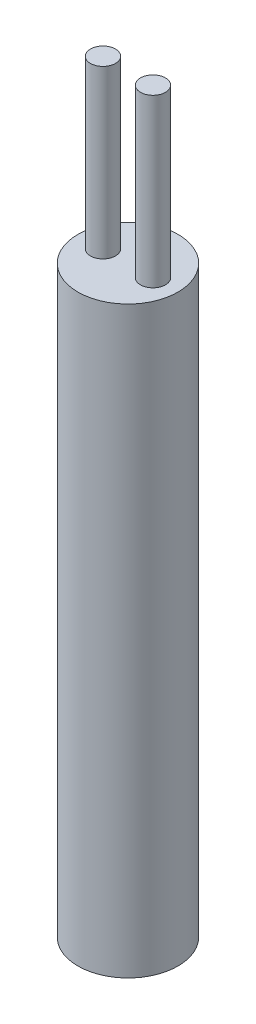
ISO-10303-21;
HEADER;
FILE_DESCRIPTION(('STEP AP214'),'2;1');
FILE_NAME('part.step','',(''),(''),'','','');
FILE_SCHEMA(('AUTOMOTIVE_DESIGN { 1 0 10303 214 1 1 1 1 }'));
ENDSEC;
DATA;
#1=APPLICATION_CONTEXT('core data for automotive mechanical design processes');
#2=APPLICATION_PROTOCOL_DEFINITION('international standard','automotive_design',2000,#1);
#3=PRODUCT_CONTEXT('',#1,'mechanical');
#4=PRODUCT('Part','Part','',(#3));
#5=PRODUCT_RELATED_PRODUCT_CATEGORY('part','',(#4));
#6=PRODUCT_DEFINITION_FORMATION('','',#4);
#7=PRODUCT_DEFINITION_CONTEXT('part definition',#1,'design');
#8=PRODUCT_DEFINITION('design','',#6,#7);
#9=PRODUCT_DEFINITION_SHAPE('','',#8);
#10=(LENGTH_UNIT() NAMED_UNIT(*) SI_UNIT(.MILLI.,.METRE.));
#11=(NAMED_UNIT(*) PLANE_ANGLE_UNIT() SI_UNIT($,.RADIAN.));
#12=(NAMED_UNIT(*) SI_UNIT($,.STERADIAN.) SOLID_ANGLE_UNIT());
#13=UNCERTAINTY_MEASURE_WITH_UNIT(LENGTH_MEASURE(1.E-05),#10,'distance_accuracy_value','');
#14=(GEOMETRIC_REPRESENTATION_CONTEXT(3) GLOBAL_UNCERTAINTY_ASSIGNED_CONTEXT((#13)) GLOBAL_UNIT_ASSIGNED_CONTEXT((#10,
#11,#12)) REPRESENTATION_CONTEXT('',''));
#15=CARTESIAN_POINT('',(0.,0.,0.));
#16=DIRECTION('',(0.,0.,1.));
#17=DIRECTION('',(1.,0.,0.));
#18=AXIS2_PLACEMENT_3D('',#15,#16,#17);
#19=CARTESIAN_POINT('',(0.,35.,0.));
#20=DIRECTION('',(0.,-1.,0.));
#21=DIRECTION('',(0.,0.,-1.));
#22=AXIS2_PLACEMENT_3D('',#19,#20,#21);
#23=CYLINDRICAL_SURFACE('',#22,3.);
#24=CARTESIAN_POINT('',(0.,35.,0.));
#25=DIRECTION('',(0.,1.,0.));
#26=DIRECTION('',(0.,0.,1.));
#27=AXIS2_PLACEMENT_3D('',#24,#25,#26);
#28=CIRCLE('',#27,3.);
#29=CARTESIAN_POINT('',(0.,35.,3.));
#30=VERTEX_POINT('',#29);
#31=EDGE_CURVE('E10',#30,#30,#28,.T.);
#32=ORIENTED_EDGE('',*,*,#31,.F.);
#33=EDGE_LOOP('',(#32));
#34=FACE_BOUND('',#33,.T.);
#35=CARTESIAN_POINT('',(0.,0.,0.));
#36=DIRECTION('',(0.,1.,0.));
#37=DIRECTION('',(0.,0.,1.));
#38=AXIS2_PLACEMENT_3D('',#35,#36,#37);
#39=CIRCLE('',#38,3.);
#40=CARTESIAN_POINT('',(0.,0.,3.));
#41=VERTEX_POINT('',#40);
#42=EDGE_CURVE('E35',#41,#41,#39,.T.);
#43=ORIENTED_EDGE('',*,*,#42,.T.);
#44=EDGE_LOOP('',(#43));
#45=FACE_BOUND('',#44,.T.);
#46=ADVANCED_FACE('F32',(#34,#45),#23,.T.);
#47=CARTESIAN_POINT('',(0.,35.,0.));
#48=DIRECTION('',(0.,1.,0.));
#49=DIRECTION('',(0.,0.,1.));
#50=AXIS2_PLACEMENT_3D('',#47,#48,#49);
#51=PLANE('',#50);
#52=CARTESIAN_POINT('',(-1.5,35.,0.));
#53=DIRECTION('',(0.,1.,0.));
#54=DIRECTION('',(0.,0.,-1.));
#55=AXIS2_PLACEMENT_3D('',#52,#53,#54);
#56=CIRCLE('',#55,0.75);
#57=CARTESIAN_POINT('',(-1.5,35.,-0.749999999999999));
#58=VERTEX_POINT('',#57);
#59=EDGE_CURVE('E50',#58,#58,#56,.T.);
#60=ORIENTED_EDGE('',*,*,#59,.F.);
#61=EDGE_LOOP('',(#60));
#62=FACE_BOUND('',#61,.T.);
#63=CARTESIAN_POINT('',(1.5,35.,0.));
#64=DIRECTION('',(0.,1.,0.));
#65=DIRECTION('',(0.,0.,1.));
#66=AXIS2_PLACEMENT_3D('',#63,#64,#65);
#67=CIRCLE('',#66,0.75);
#68=CARTESIAN_POINT('',(1.5,35.,0.750000000000002));
#69=VERTEX_POINT('',#68);
#70=EDGE_CURVE('E44',#69,#69,#67,.T.);
#71=ORIENTED_EDGE('',*,*,#70,.F.);
#72=EDGE_LOOP('',(#71));
#73=FACE_BOUND('',#72,.T.);
#74=ORIENTED_EDGE('',*,*,#31,.T.);
#75=EDGE_LOOP('',(#74));
#76=FACE_BOUND('',#75,.T.);
#77=ADVANCED_FACE('F65',(#62,#73,#76),#51,.T.);
#78=CARTESIAN_POINT('',(0.,0.,0.));
#79=DIRECTION('',(0.,1.,0.));
#80=DIRECTION('',(0.,0.,1.));
#81=AXIS2_PLACEMENT_3D('',#78,#79,#80);
#82=PLANE('',#81);
#83=ORIENTED_EDGE('',*,*,#42,.F.);
#84=EDGE_LOOP('',(#83));
#85=FACE_BOUND('',#84,.T.);
#86=ADVANCED_FACE('F68',(#85),#82,.F.);
#87=CARTESIAN_POINT('',(1.5,45.,0.));
#88=DIRECTION('',(0.,-1.,0.));
#89=DIRECTION('',(0.,0.,-1.));
#90=AXIS2_PLACEMENT_3D('',#87,#88,#89);
#91=CYLINDRICAL_SURFACE('',#90,0.75);
#92=CARTESIAN_POINT('',(1.5,45.,0.));
#93=DIRECTION('',(0.,1.,0.));
#94=DIRECTION('',(0.,0.,1.));
#95=AXIS2_PLACEMENT_3D('',#92,#93,#94);
#96=CIRCLE('',#95,0.75);
#97=CARTESIAN_POINT('',(1.5,45.,0.750000000000002));
#98=VERTEX_POINT('',#97);
#99=EDGE_CURVE('E42',#98,#98,#96,.T.);
#100=ORIENTED_EDGE('',*,*,#99,.F.);
#101=EDGE_LOOP('',(#100));
#102=FACE_BOUND('',#101,.T.);
#103=ORIENTED_EDGE('',*,*,#70,.T.);
#104=EDGE_LOOP('',(#103));
#105=FACE_BOUND('',#104,.T.);
#106=ADVANCED_FACE('F72',(#102,#105),#91,.T.);
#107=CARTESIAN_POINT('',(1.5,45.,0.));
#108=DIRECTION('',(0.,1.,0.));
#109=DIRECTION('',(0.,0.,1.));
#110=AXIS2_PLACEMENT_3D('',#107,#108,#109);
#111=PLANE('',#110);
#112=ORIENTED_EDGE('',*,*,#99,.T.);
#113=EDGE_LOOP('',(#112));
#114=FACE_BOUND('',#113,.T.);
#115=ADVANCED_FACE('F61',(#114),#111,.T.);
#116=CARTESIAN_POINT('',(-1.5,45.,0.));
#117=DIRECTION('',(0.,-1.,0.));
#118=DIRECTION('',(0.,0.,-1.));
#119=AXIS2_PLACEMENT_3D('',#116,#117,#118);
#120=CYLINDRICAL_SURFACE('',#119,0.75);
#121=CARTESIAN_POINT('',(-1.5,45.,0.));
#122=DIRECTION('',(0.,1.,0.));
#123=DIRECTION('',(0.,0.,-1.));
#124=AXIS2_PLACEMENT_3D('',#121,#122,#123);
#125=CIRCLE('',#124,0.75);
#126=CARTESIAN_POINT('',(-1.5,45.,-0.749999999999999));
#127=VERTEX_POINT('',#126);
#128=EDGE_CURVE('E47',#127,#127,#125,.T.);
#129=ORIENTED_EDGE('',*,*,#128,.F.);
#130=EDGE_LOOP('',(#129));
#131=FACE_BOUND('',#130,.T.);
#132=ORIENTED_EDGE('',*,*,#59,.T.);
#133=EDGE_LOOP('',(#132));
#134=FACE_BOUND('',#133,.T.);
#135=ADVANCED_FACE('F58',(#131,#134),#120,.T.);
#136=CARTESIAN_POINT('',(-1.5,45.,0.));
#137=DIRECTION('',(0.,-1.,0.));
#138=DIRECTION('',(0.,0.,-1.));
#139=AXIS2_PLACEMENT_3D('',#136,#137,#138);
#140=PLANE('',#139);
#141=ORIENTED_EDGE('',*,*,#128,.T.);
#142=EDGE_LOOP('',(#141));
#143=FACE_BOUND('',#142,.T.);
#144=ADVANCED_FACE('F56',(#143),#140,.F.);
#145=CLOSED_SHELL('',(#46,#77,#86,#106,#115,#135,#144));
#146=MANIFOLD_SOLID_BREP('B2',#145);
#147=ADVANCED_BREP_SHAPE_REPRESENTATION('',(#18,#146),#14);
#148=SHAPE_DEFINITION_REPRESENTATION(#9,#147);
ENDSEC;
END-ISO-10303-21;
